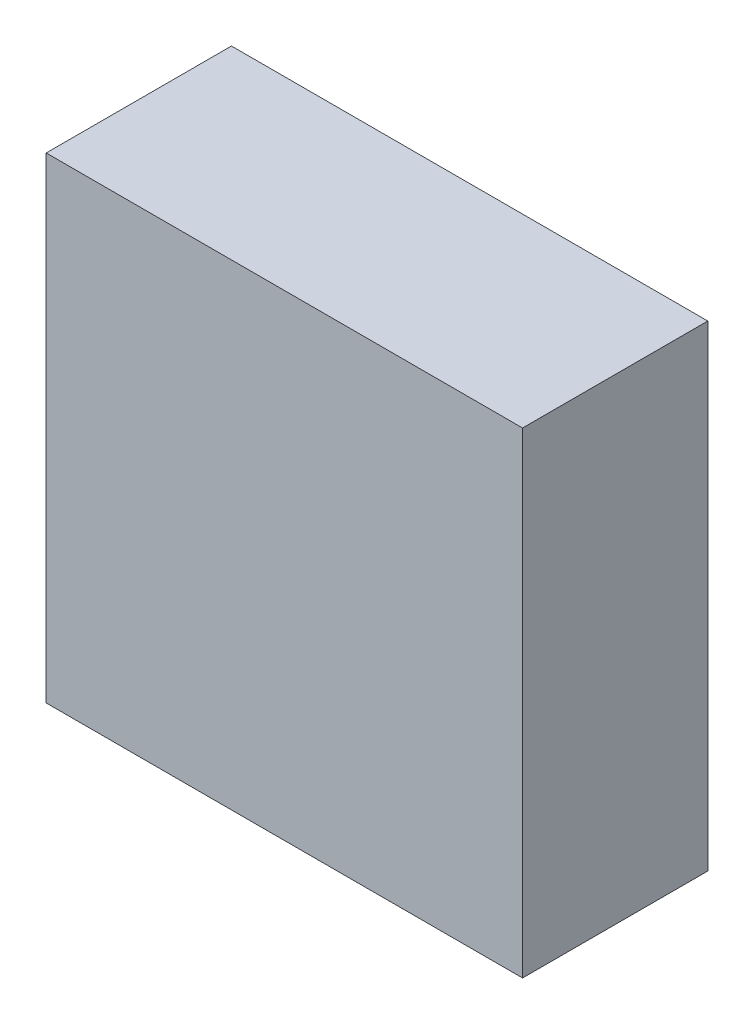
ISO-10303-21;
HEADER;
FILE_DESCRIPTION(('STEP AP214'),'2;1');
FILE_NAME('part.step','',(''),(''),'','','');
FILE_SCHEMA(('AUTOMOTIVE_DESIGN { 1 0 10303 214 1 1 1 1 }'));
ENDSEC;
DATA;
#1=APPLICATION_CONTEXT('core data for automotive mechanical design processes');
#2=APPLICATION_PROTOCOL_DEFINITION('international standard','automotive_design',2000,#1);
#3=PRODUCT_CONTEXT('',#1,'mechanical');
#4=PRODUCT('Part','Part','',(#3));
#5=PRODUCT_RELATED_PRODUCT_CATEGORY('part','',(#4));
#6=PRODUCT_DEFINITION_FORMATION('','',#4);
#7=PRODUCT_DEFINITION_CONTEXT('part definition',#1,'design');
#8=PRODUCT_DEFINITION('design','',#6,#7);
#9=PRODUCT_DEFINITION_SHAPE('','',#8);
#10=(LENGTH_UNIT() NAMED_UNIT(*) SI_UNIT(.MILLI.,.METRE.));
#11=(NAMED_UNIT(*) PLANE_ANGLE_UNIT() SI_UNIT($,.RADIAN.));
#12=(NAMED_UNIT(*) SI_UNIT($,.STERADIAN.) SOLID_ANGLE_UNIT());
#13=UNCERTAINTY_MEASURE_WITH_UNIT(LENGTH_MEASURE(1.E-05),#10,'distance_accuracy_value','');
#14=(GEOMETRIC_REPRESENTATION_CONTEXT(3) GLOBAL_UNCERTAINTY_ASSIGNED_CONTEXT((#13)) GLOBAL_UNIT_ASSIGNED_CONTEXT((#10,
#11,#12)) REPRESENTATION_CONTEXT('',''));
#15=CARTESIAN_POINT('',(0.,0.,0.));
#16=DIRECTION('',(0.,0.,1.));
#17=DIRECTION('',(1.,0.,0.));
#18=AXIS2_PLACEMENT_3D('',#15,#16,#17);
#19=CARTESIAN_POINT('',(0.,0.,35.));
#20=DIRECTION('',(1.,0.,0.));
#21=DIRECTION('',(0.,1.,0.));
#22=AXIS2_PLACEMENT_3D('',#19,#20,#21);
#23=PLANE('',#22);
#24=DIRECTION('',(0.,-1.,0.));
#25=VECTOR('',#24,1.);
#26=CARTESIAN_POINT('',(0.,0.,0.));
#27=LINE('',#26,#25);
#28=CARTESIAN_POINT('',(0.,0.,0.));
#29=VERTEX_POINT('',#28);
#30=CARTESIAN_POINT('',(0.,-90.,0.));
#31=VERTEX_POINT('',#30);
#32=EDGE_CURVE('E98',#29,#31,#27,.T.);
#33=ORIENTED_EDGE('',*,*,#32,.T.);
#34=DIRECTION('',(0.,0.,-1.));
#35=VECTOR('',#34,1.);
#36=CARTESIAN_POINT('',(0.,-90.,35.));
#37=LINE('',#36,#35);
#38=CARTESIAN_POINT('',(0.,-90.,35.));
#39=VERTEX_POINT('',#38);
#40=EDGE_CURVE('E11',#39,#31,#37,.T.);
#41=ORIENTED_EDGE('',*,*,#40,.F.);
#42=DIRECTION('',(0.,-1.,0.));
#43=VECTOR('',#42,1.);
#44=CARTESIAN_POINT('',(0.,0.,35.));
#45=LINE('',#44,#43);
#46=CARTESIAN_POINT('',(0.,0.,35.));
#47=VERTEX_POINT('',#46);
#48=EDGE_CURVE('E86',#47,#39,#45,.T.);
#49=ORIENTED_EDGE('',*,*,#48,.F.);
#50=DIRECTION('',(0.,0.,-1.));
#51=VECTOR('',#50,1.);
#52=CARTESIAN_POINT('',(0.,0.,35.));
#53=LINE('',#52,#51);
#54=EDGE_CURVE('E94',#47,#29,#53,.T.);
#55=ORIENTED_EDGE('',*,*,#54,.T.);
#56=EDGE_LOOP('',(#33,#41,#49,#55));
#57=FACE_BOUND('',#56,.T.);
#58=ADVANCED_FACE('F35',(#57),#23,.F.);
#59=CARTESIAN_POINT('',(0.,-90.,35.));
#60=DIRECTION('',(0.,1.,0.));
#61=DIRECTION('',(0.,0.,1.));
#62=AXIS2_PLACEMENT_3D('',#59,#60,#61);
#63=PLANE('',#62);
#64=DIRECTION('',(1.,0.,0.));
#65=VECTOR('',#64,1.);
#66=CARTESIAN_POINT('',(0.,-90.,0.));
#67=LINE('',#66,#65);
#68=CARTESIAN_POINT('',(90.,-90.,0.));
#69=VERTEX_POINT('',#68);
#70=EDGE_CURVE('E90',#31,#69,#67,.T.);
#71=ORIENTED_EDGE('',*,*,#70,.T.);
#72=DIRECTION('',(0.,0.,-1.));
#73=VECTOR('',#72,1.);
#74=CARTESIAN_POINT('',(90.,-90.,35.));
#75=LINE('',#74,#73);
#76=CARTESIAN_POINT('',(90.,-90.,35.));
#77=VERTEX_POINT('',#76);
#78=EDGE_CURVE('E43',#77,#69,#75,.T.);
#79=ORIENTED_EDGE('',*,*,#78,.F.);
#80=DIRECTION('',(1.,0.,0.));
#81=VECTOR('',#80,1.);
#82=CARTESIAN_POINT('',(0.,-90.,35.));
#83=LINE('',#82,#81);
#84=EDGE_CURVE('E81',#39,#77,#83,.T.);
#85=ORIENTED_EDGE('',*,*,#84,.F.);
#86=ORIENTED_EDGE('',*,*,#40,.T.);
#87=EDGE_LOOP('',(#71,#79,#85,#86));
#88=FACE_BOUND('',#87,.T.);
#89=ADVANCED_FACE('F89',(#88),#63,.F.);
#90=CARTESIAN_POINT('',(90.,0.,35.));
#91=DIRECTION('',(-1.,0.,0.));
#92=DIRECTION('',(0.,-1.,0.));
#93=AXIS2_PLACEMENT_3D('',#90,#91,#92);
#94=PLANE('',#93);
#95=DIRECTION('',(0.,1.,0.));
#96=VECTOR('',#95,1.);
#97=CARTESIAN_POINT('',(90.,0.,0.));
#98=LINE('',#97,#96);
#99=CARTESIAN_POINT('',(90.,0.,0.));
#100=VERTEX_POINT('',#99);
#101=EDGE_CURVE('E68',#69,#100,#98,.T.);
#102=ORIENTED_EDGE('',*,*,#101,.T.);
#103=DIRECTION('',(0.,0.,-1.));
#104=VECTOR('',#103,1.);
#105=CARTESIAN_POINT('',(90.,0.,35.));
#106=LINE('',#105,#104);
#107=CARTESIAN_POINT('',(90.,0.,35.));
#108=VERTEX_POINT('',#107);
#109=EDGE_CURVE('E91',#108,#100,#106,.T.);
#110=ORIENTED_EDGE('',*,*,#109,.F.);
#111=DIRECTION('',(0.,1.,0.));
#112=VECTOR('',#111,1.);
#113=CARTESIAN_POINT('',(90.,0.,35.));
#114=LINE('',#113,#112);
#115=EDGE_CURVE('E84',#77,#108,#114,.T.);
#116=ORIENTED_EDGE('',*,*,#115,.F.);
#117=ORIENTED_EDGE('',*,*,#78,.T.);
#118=EDGE_LOOP('',(#102,#110,#116,#117));
#119=FACE_BOUND('',#118,.T.);
#120=ADVANCED_FACE('F92',(#119),#94,.F.);
#121=CARTESIAN_POINT('',(0.,0.,35.));
#122=DIRECTION('',(0.,-1.,0.));
#123=DIRECTION('',(0.,0.,-1.));
#124=AXIS2_PLACEMENT_3D('',#121,#122,#123);
#125=PLANE('',#124);
#126=DIRECTION('',(-1.,0.,0.));
#127=VECTOR('',#126,1.);
#128=CARTESIAN_POINT('',(0.,0.,0.));
#129=LINE('',#128,#127);
#130=EDGE_CURVE('E74',#100,#29,#129,.T.);
#131=ORIENTED_EDGE('',*,*,#130,.T.);
#132=ORIENTED_EDGE('',*,*,#54,.F.);
#133=DIRECTION('',(-1.,0.,0.));
#134=VECTOR('',#133,1.);
#135=CARTESIAN_POINT('',(0.,0.,35.));
#136=LINE('',#135,#134);
#137=EDGE_CURVE('E51',#108,#47,#136,.T.);
#138=ORIENTED_EDGE('',*,*,#137,.F.);
#139=ORIENTED_EDGE('',*,*,#109,.T.);
#140=EDGE_LOOP('',(#131,#132,#138,#139));
#141=FACE_BOUND('',#140,.T.);
#142=ADVANCED_FACE('F105',(#141),#125,.F.);
#143=CARTESIAN_POINT('',(0.,0.,35.));
#144=DIRECTION('',(0.,0.,1.));
#145=DIRECTION('',(1.,0.,0.));
#146=AXIS2_PLACEMENT_3D('',#143,#144,#145);
#147=PLANE('',#146);
#148=ORIENTED_EDGE('',*,*,#48,.T.);
#149=ORIENTED_EDGE('',*,*,#84,.T.);
#150=ORIENTED_EDGE('',*,*,#115,.T.);
#151=ORIENTED_EDGE('',*,*,#137,.T.);
#152=EDGE_LOOP('',(#148,#149,#150,#151));
#153=FACE_BOUND('',#152,.T.);
#154=ADVANCED_FACE('F82',(#153),#147,.T.);
#155=CARTESIAN_POINT('',(0.,0.,0.));
#156=DIRECTION('',(0.,0.,1.));
#157=DIRECTION('',(1.,0.,0.));
#158=AXIS2_PLACEMENT_3D('',#155,#156,#157);
#159=PLANE('',#158);
#160=ORIENTED_EDGE('',*,*,#32,.F.);
#161=ORIENTED_EDGE('',*,*,#130,.F.);
#162=ORIENTED_EDGE('',*,*,#101,.F.);
#163=ORIENTED_EDGE('',*,*,#70,.F.);
#164=EDGE_LOOP('',(#160,#161,#162,#163));
#165=FACE_BOUND('',#164,.T.);
#166=ADVANCED_FACE('F108',(#165),#159,.F.);
#167=CLOSED_SHELL('',(#58,#89,#120,#142,#154,#166));
#168=MANIFOLD_SOLID_BREP('B2',#167);
#169=ADVANCED_BREP_SHAPE_REPRESENTATION('',(#18,#168),#14);
#170=SHAPE_DEFINITION_REPRESENTATION(#9,#169);
ENDSEC;
END-ISO-10303-21;
